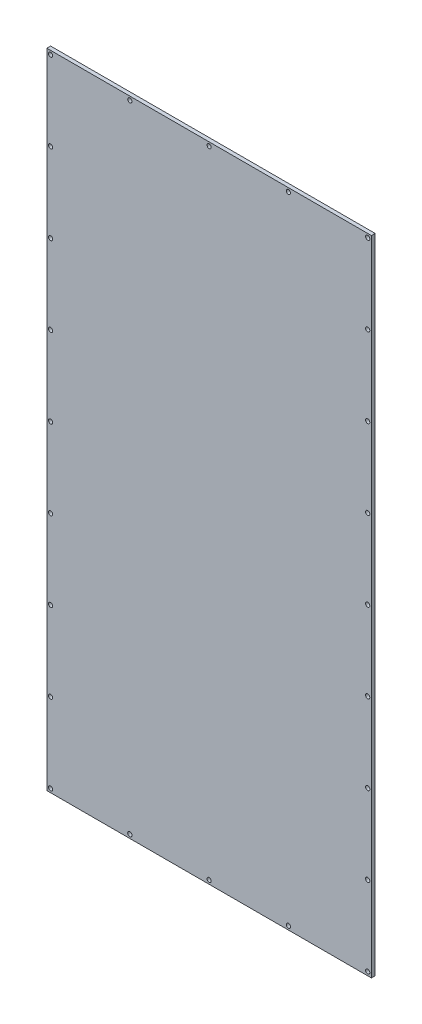
ISO-10303-21;
HEADER;
FILE_DESCRIPTION(('STEP AP214'),'2;1');
FILE_NAME('part.step','',(''),(''),'','','');
FILE_SCHEMA(('AUTOMOTIVE_DESIGN { 1 0 10303 214 1 1 1 1 }'));
ENDSEC;
DATA;
#1=APPLICATION_CONTEXT('core data for automotive mechanical design processes');
#2=APPLICATION_PROTOCOL_DEFINITION('international standard','automotive_design',2000,#1);
#3=PRODUCT_CONTEXT('',#1,'mechanical');
#4=PRODUCT('Part','Part','',(#3));
#5=PRODUCT_RELATED_PRODUCT_CATEGORY('part','',(#4));
#6=PRODUCT_DEFINITION_FORMATION('','',#4);
#7=PRODUCT_DEFINITION_CONTEXT('part definition',#1,'design');
#8=PRODUCT_DEFINITION('design','',#6,#7);
#9=PRODUCT_DEFINITION_SHAPE('','',#8);
#10=(LENGTH_UNIT() NAMED_UNIT(*) SI_UNIT(.MILLI.,.METRE.));
#11=(NAMED_UNIT(*) PLANE_ANGLE_UNIT() SI_UNIT($,.RADIAN.));
#12=(NAMED_UNIT(*) SI_UNIT($,.STERADIAN.) SOLID_ANGLE_UNIT());
#13=UNCERTAINTY_MEASURE_WITH_UNIT(LENGTH_MEASURE(1.E-05),#10,'distance_accuracy_value','');
#14=(GEOMETRIC_REPRESENTATION_CONTEXT(3) GLOBAL_UNCERTAINTY_ASSIGNED_CONTEXT((#13)) GLOBAL_UNIT_ASSIGNED_CONTEXT((#10,
#11,#12)) REPRESENTATION_CONTEXT('',''));
#15=CARTESIAN_POINT('',(0.,0.,0.));
#16=DIRECTION('',(0.,0.,1.));
#17=DIRECTION('',(1.,0.,0.));
#18=AXIS2_PLACEMENT_3D('',#15,#16,#17);
#19=CARTESIAN_POINT('',(0.,0.,0.));
#20=DIRECTION('',(0.,0.,-1.));
#21=DIRECTION('',(-1.,0.,0.));
#22=AXIS2_PLACEMENT_3D('',#19,#20,#21);
#23=PLANE('',#22);
#24=CARTESIAN_POINT('',(3.,3.,0.));
#25=DIRECTION('',(0.,0.,1.));
#26=DIRECTION('',(1.,0.,0.));
#27=AXIS2_PLACEMENT_3D('',#24,#25,#26);
#28=CIRCLE('',#27,1.7);
#29=CARTESIAN_POINT('',(4.7,3.,0.));
#30=VERTEX_POINT('',#29);
#31=EDGE_CURVE('E236',#30,#30,#28,.T.);
#32=ORIENTED_EDGE('',*,*,#31,.T.);
#33=EDGE_LOOP('',(#32));
#34=FACE_BOUND('',#33,.T.);
#35=CARTESIAN_POINT('',(66.5,3.,0.));
#36=DIRECTION('',(0.,0.,1.));
#37=DIRECTION('',(1.,0.,0.));
#38=AXIS2_PLACEMENT_3D('',#35,#36,#37);
#39=CIRCLE('',#38,1.69999999999999);
#40=CARTESIAN_POINT('',(68.2,3.,0.));
#41=VERTEX_POINT('',#40);
#42=EDGE_CURVE('E230',#41,#41,#39,.T.);
#43=ORIENTED_EDGE('',*,*,#42,.T.);
#44=EDGE_LOOP('',(#43));
#45=FACE_BOUND('',#44,.T.);
#46=CARTESIAN_POINT('',(3.,130.25,0.));
#47=DIRECTION('',(0.,0.,1.));
#48=DIRECTION('',(1.,0.,0.));
#49=AXIS2_PLACEMENT_3D('',#46,#47,#48);
#50=CIRCLE('',#49,1.7);
#51=CARTESIAN_POINT('',(4.7,130.25,0.));
#52=VERTEX_POINT('',#51);
#53=EDGE_CURVE('E212',#52,#52,#50,.T.);
#54=ORIENTED_EDGE('',*,*,#53,.T.);
#55=EDGE_LOOP('',(#54));
#56=FACE_BOUND('',#55,.T.);
#57=CARTESIAN_POINT('',(3.,193.875,0.));
#58=DIRECTION('',(0.,0.,1.));
#59=DIRECTION('',(1.,0.,0.));
#60=AXIS2_PLACEMENT_3D('',#57,#58,#59);
#61=CIRCLE('',#60,1.7);
#62=CARTESIAN_POINT('',(4.7,193.875,0.));
#63=VERTEX_POINT('',#62);
#64=EDGE_CURVE('E206',#63,#63,#61,.T.);
#65=ORIENTED_EDGE('',*,*,#64,.T.);
#66=EDGE_LOOP('',(#65));
#67=FACE_BOUND('',#66,.T.);
#68=CARTESIAN_POINT('',(3.,321.125,0.));
#69=DIRECTION('',(0.,0.,1.));
#70=DIRECTION('',(1.,0.,0.));
#71=AXIS2_PLACEMENT_3D('',#68,#69,#70);
#72=CIRCLE('',#71,1.7);
#73=CARTESIAN_POINT('',(4.7,321.125,0.));
#74=VERTEX_POINT('',#73);
#75=EDGE_CURVE('E188',#74,#74,#72,.T.);
#76=ORIENTED_EDGE('',*,*,#75,.T.);
#77=EDGE_LOOP('',(#76));
#78=FACE_BOUND('',#77,.T.);
#79=CARTESIAN_POINT('',(3.,257.5,0.));
#80=DIRECTION('',(0.,0.,1.));
#81=DIRECTION('',(1.,0.,0.));
#82=AXIS2_PLACEMENT_3D('',#79,#80,#81);
#83=CIRCLE('',#82,1.7);
#84=CARTESIAN_POINT('',(4.7,257.5,0.));
#85=VERTEX_POINT('',#84);
#86=EDGE_CURVE('E182',#85,#85,#83,.T.);
#87=ORIENTED_EDGE('',*,*,#86,.T.);
#88=EDGE_LOOP('',(#87));
#89=FACE_BOUND('',#88,.T.);
#90=CARTESIAN_POINT('',(257.,130.25,0.));
#91=DIRECTION('',(0.,0.,1.));
#92=DIRECTION('',(1.,0.,0.));
#93=AXIS2_PLACEMENT_3D('',#90,#91,#92);
#94=CIRCLE('',#93,1.69999999999998);
#95=CARTESIAN_POINT('',(258.7,130.25,0.));
#96=VERTEX_POINT('',#95);
#97=EDGE_CURVE('E146',#96,#96,#94,.T.);
#98=ORIENTED_EDGE('',*,*,#97,.T.);
#99=EDGE_LOOP('',(#98));
#100=FACE_BOUND('',#99,.T.);
#101=CARTESIAN_POINT('',(257.,193.875,0.));
#102=DIRECTION('',(0.,0.,1.));
#103=DIRECTION('',(1.,0.,0.));
#104=AXIS2_PLACEMENT_3D('',#101,#102,#103);
#105=CIRCLE('',#104,1.69999999999998);
#106=CARTESIAN_POINT('',(258.7,193.875,0.));
#107=VERTEX_POINT('',#106);
#108=EDGE_CURVE('E140',#107,#107,#105,.T.);
#109=ORIENTED_EDGE('',*,*,#108,.T.);
#110=EDGE_LOOP('',(#109));
#111=FACE_BOUND('',#110,.T.);
#112=CARTESIAN_POINT('',(257.,448.375,0.));
#113=DIRECTION('',(0.,0.,1.));
#114=DIRECTION('',(1.,0.,0.));
#115=AXIS2_PLACEMENT_3D('',#112,#113,#114);
#116=CIRCLE('',#115,1.69999999999998);
#117=CARTESIAN_POINT('',(258.7,448.375,0.));
#118=VERTEX_POINT('',#117);
#119=EDGE_CURVE('E134',#118,#118,#116,.T.);
#120=ORIENTED_EDGE('',*,*,#119,.T.);
#121=EDGE_LOOP('',(#120));
#122=FACE_BOUND('',#121,.T.);
#123=CARTESIAN_POINT('',(257.,384.75,0.));
#124=DIRECTION('',(0.,0.,1.));
#125=DIRECTION('',(1.,0.,0.));
#126=AXIS2_PLACEMENT_3D('',#123,#124,#125);
#127=CIRCLE('',#126,1.69999999999998);
#128=CARTESIAN_POINT('',(258.7,384.75,0.));
#129=VERTEX_POINT('',#128);
#130=EDGE_CURVE('E128',#129,#129,#127,.T.);
#131=ORIENTED_EDGE('',*,*,#130,.T.);
#132=EDGE_LOOP('',(#131));
#133=FACE_BOUND('',#132,.T.);
#134=CARTESIAN_POINT('',(257.,321.125,0.));
#135=DIRECTION('',(0.,0.,1.));
#136=DIRECTION('',(1.,0.,0.));
#137=AXIS2_PLACEMENT_3D('',#134,#135,#136);
#138=CIRCLE('',#137,1.69999999999998);
#139=CARTESIAN_POINT('',(258.7,321.125,0.));
#140=VERTEX_POINT('',#139);
#141=EDGE_CURVE('E122',#140,#140,#138,.T.);
#142=ORIENTED_EDGE('',*,*,#141,.T.);
#143=EDGE_LOOP('',(#142));
#144=FACE_BOUND('',#143,.T.);
#145=CARTESIAN_POINT('',(130.,512.,0.));
#146=DIRECTION('',(0.,0.,1.));
#147=DIRECTION('',(1.,0.,0.));
#148=AXIS2_PLACEMENT_3D('',#145,#146,#147);
#149=CIRCLE('',#148,1.70000000000001);
#150=CARTESIAN_POINT('',(131.7,512.,0.));
#151=VERTEX_POINT('',#150);
#152=EDGE_CURVE('E116',#151,#151,#149,.T.);
#153=ORIENTED_EDGE('',*,*,#152,.T.);
#154=EDGE_LOOP('',(#153));
#155=FACE_BOUND('',#154,.T.);
#156=CARTESIAN_POINT('',(257.,257.5,0.));
#157=DIRECTION('',(0.,0.,1.));
#158=DIRECTION('',(1.,0.,0.));
#159=AXIS2_PLACEMENT_3D('',#156,#157,#158);
#160=CIRCLE('',#159,1.69999999999998);
#161=CARTESIAN_POINT('',(258.7,257.5,0.));
#162=VERTEX_POINT('',#161);
#163=EDGE_CURVE('E100',#162,#162,#160,.T.);
#164=ORIENTED_EDGE('',*,*,#163,.T.);
#165=EDGE_LOOP('',(#164));
#166=FACE_BOUND('',#165,.T.);
#167=DIRECTION('',(0.,-1.,0.));
#168=VECTOR('',#167,1.);
#169=CARTESIAN_POINT('',(0.,0.,0.));
#170=LINE('',#169,#168);
#171=CARTESIAN_POINT('',(0.,515.,0.));
#172=VERTEX_POINT('',#171);
#173=CARTESIAN_POINT('',(0.,0.,0.));
#174=VERTEX_POINT('',#173);
#175=EDGE_CURVE('E97',#172,#174,#170,.T.);
#176=ORIENTED_EDGE('',*,*,#175,.F.);
#177=DIRECTION('',(-1.,0.,0.));
#178=VECTOR('',#177,1.);
#179=CARTESIAN_POINT('',(0.,515.,0.));
#180=LINE('',#179,#178);
#181=CARTESIAN_POINT('',(260.,515.,0.));
#182=VERTEX_POINT('',#181);
#183=EDGE_CURVE('E72',#182,#172,#180,.T.);
#184=ORIENTED_EDGE('',*,*,#183,.F.);
#185=DIRECTION('',(0.,1.,0.));
#186=VECTOR('',#185,1.);
#187=CARTESIAN_POINT('',(260.,0.,0.));
#188=LINE('',#187,#186);
#189=CARTESIAN_POINT('',(260.,0.,0.));
#190=VERTEX_POINT('',#189);
#191=EDGE_CURVE('E66',#190,#182,#188,.T.);
#192=ORIENTED_EDGE('',*,*,#191,.F.);
#193=DIRECTION('',(1.,0.,0.));
#194=VECTOR('',#193,1.);
#195=CARTESIAN_POINT('',(0.,0.,0.));
#196=LINE('',#195,#194);
#197=EDGE_CURVE('E89',#174,#190,#196,.T.);
#198=ORIENTED_EDGE('',*,*,#197,.F.);
#199=EDGE_LOOP('',(#176,#184,#192,#198));
#200=FACE_BOUND('',#199,.T.);
#201=CARTESIAN_POINT('',(257.,66.625,0.));
#202=DIRECTION('',(0.,0.,1.));
#203=DIRECTION('',(1.,0.,0.));
#204=AXIS2_PLACEMENT_3D('',#201,#202,#203);
#205=CIRCLE('',#204,1.69999999999998);
#206=CARTESIAN_POINT('',(258.7,66.625,0.));
#207=VERTEX_POINT('',#206);
#208=EDGE_CURVE('E152',#207,#207,#205,.T.);
#209=ORIENTED_EDGE('',*,*,#208,.T.);
#210=EDGE_LOOP('',(#209));
#211=FACE_BOUND('',#210,.T.);
#212=CARTESIAN_POINT('',(66.5,512.,0.));
#213=DIRECTION('',(0.,0.,1.));
#214=DIRECTION('',(1.,0.,0.));
#215=AXIS2_PLACEMENT_3D('',#212,#213,#214);
#216=CIRCLE('',#215,1.69999999999999);
#217=CARTESIAN_POINT('',(68.2,512.,0.));
#218=VERTEX_POINT('',#217);
#219=EDGE_CURVE('E158',#218,#218,#216,.T.);
#220=ORIENTED_EDGE('',*,*,#219,.T.);
#221=EDGE_LOOP('',(#220));
#222=FACE_BOUND('',#221,.T.);
#223=CARTESIAN_POINT('',(3.,512.,0.));
#224=DIRECTION('',(0.,0.,1.));
#225=DIRECTION('',(1.,0.,0.));
#226=AXIS2_PLACEMENT_3D('',#223,#224,#225);
#227=CIRCLE('',#226,1.7);
#228=CARTESIAN_POINT('',(4.7,512.,0.));
#229=VERTEX_POINT('',#228);
#230=EDGE_CURVE('E164',#229,#229,#227,.T.);
#231=ORIENTED_EDGE('',*,*,#230,.T.);
#232=EDGE_LOOP('',(#231));
#233=FACE_BOUND('',#232,.T.);
#234=CARTESIAN_POINT('',(193.5,512.,0.));
#235=DIRECTION('',(0.,0.,1.));
#236=DIRECTION('',(1.,0.,0.));
#237=AXIS2_PLACEMENT_3D('',#234,#235,#236);
#238=CIRCLE('',#237,1.70000000000001);
#239=CARTESIAN_POINT('',(195.2,512.,0.));
#240=VERTEX_POINT('',#239);
#241=EDGE_CURVE('E170',#240,#240,#238,.T.);
#242=ORIENTED_EDGE('',*,*,#241,.T.);
#243=EDGE_LOOP('',(#242));
#244=FACE_BOUND('',#243,.T.);
#245=CARTESIAN_POINT('',(257.,512.,0.));
#246=DIRECTION('',(0.,0.,1.));
#247=DIRECTION('',(1.,0.,0.));
#248=AXIS2_PLACEMENT_3D('',#245,#246,#247);
#249=CIRCLE('',#248,1.69999999999998);
#250=CARTESIAN_POINT('',(258.7,512.,0.));
#251=VERTEX_POINT('',#250);
#252=EDGE_CURVE('E176',#251,#251,#249,.T.);
#253=ORIENTED_EDGE('',*,*,#252,.T.);
#254=EDGE_LOOP('',(#253));
#255=FACE_BOUND('',#254,.T.);
#256=CARTESIAN_POINT('',(3.,384.75,0.));
#257=DIRECTION('',(0.,0.,1.));
#258=DIRECTION('',(1.,0.,0.));
#259=AXIS2_PLACEMENT_3D('',#256,#257,#258);
#260=CIRCLE('',#259,1.7);
#261=CARTESIAN_POINT('',(4.7,384.75,0.));
#262=VERTEX_POINT('',#261);
#263=EDGE_CURVE('E194',#262,#262,#260,.T.);
#264=ORIENTED_EDGE('',*,*,#263,.T.);
#265=EDGE_LOOP('',(#264));
#266=FACE_BOUND('',#265,.T.);
#267=CARTESIAN_POINT('',(3.,448.375,0.));
#268=DIRECTION('',(0.,0.,1.));
#269=DIRECTION('',(1.,0.,0.));
#270=AXIS2_PLACEMENT_3D('',#267,#268,#269);
#271=CIRCLE('',#270,1.7);
#272=CARTESIAN_POINT('',(4.7,448.375,0.));
#273=VERTEX_POINT('',#272);
#274=EDGE_CURVE('E200',#273,#273,#271,.T.);
#275=ORIENTED_EDGE('',*,*,#274,.T.);
#276=EDGE_LOOP('',(#275));
#277=FACE_BOUND('',#276,.T.);
#278=CARTESIAN_POINT('',(3.,66.625,0.));
#279=DIRECTION('',(0.,0.,1.));
#280=DIRECTION('',(1.,0.,0.));
#281=AXIS2_PLACEMENT_3D('',#278,#279,#280);
#282=CIRCLE('',#281,1.7);
#283=CARTESIAN_POINT('',(4.7,66.625,0.));
#284=VERTEX_POINT('',#283);
#285=EDGE_CURVE('E218',#284,#284,#282,.T.);
#286=ORIENTED_EDGE('',*,*,#285,.T.);
#287=EDGE_LOOP('',(#286));
#288=FACE_BOUND('',#287,.T.);
#289=CARTESIAN_POINT('',(130.,3.,0.));
#290=DIRECTION('',(0.,0.,1.));
#291=DIRECTION('',(1.,0.,0.));
#292=AXIS2_PLACEMENT_3D('',#289,#290,#291);
#293=CIRCLE('',#292,1.70000000000001);
#294=CARTESIAN_POINT('',(131.7,3.,0.));
#295=VERTEX_POINT('',#294);
#296=EDGE_CURVE('E224',#295,#295,#293,.T.);
#297=ORIENTED_EDGE('',*,*,#296,.T.);
#298=EDGE_LOOP('',(#297));
#299=FACE_BOUND('',#298,.T.);
#300=CARTESIAN_POINT('',(193.5,3.,0.));
#301=DIRECTION('',(0.,0.,1.));
#302=DIRECTION('',(1.,0.,0.));
#303=AXIS2_PLACEMENT_3D('',#300,#301,#302);
#304=CIRCLE('',#303,1.70000000000001);
#305=CARTESIAN_POINT('',(195.2,3.,0.));
#306=VERTEX_POINT('',#305);
#307=EDGE_CURVE('E242',#306,#306,#304,.T.);
#308=ORIENTED_EDGE('',*,*,#307,.T.);
#309=EDGE_LOOP('',(#308));
#310=FACE_BOUND('',#309,.T.);
#311=CARTESIAN_POINT('',(257.,3.,0.));
#312=DIRECTION('',(0.,0.,1.));
#313=DIRECTION('',(1.,0.,0.));
#314=AXIS2_PLACEMENT_3D('',#311,#312,#313);
#315=CIRCLE('',#314,1.69999999999998);
#316=CARTESIAN_POINT('',(258.7,3.,0.));
#317=VERTEX_POINT('',#316);
#318=EDGE_CURVE('E248',#317,#317,#315,.T.);
#319=ORIENTED_EDGE('',*,*,#318,.T.);
#320=EDGE_LOOP('',(#319));
#321=FACE_BOUND('',#320,.T.);
#322=ADVANCED_FACE('F32',(#34,#45,#56,#67,#78,#89,#100,#111,#122,#133,#144,#155,#166,#200,#211,
#222,#233,#244,#255,#266,#277,#288,#299,#310,#321),#23,.T.);
#323=CARTESIAN_POINT('',(0.,0.,2.9972));
#324=DIRECTION('',(0.,0.,-1.));
#325=DIRECTION('',(-1.,0.,0.));
#326=AXIS2_PLACEMENT_3D('',#323,#324,#325);
#327=PLANE('',#326);
#328=CARTESIAN_POINT('',(257.,3.,2.9972));
#329=DIRECTION('',(0.,0.,1.));
#330=DIRECTION('',(1.,0.,0.));
#331=AXIS2_PLACEMENT_3D('',#328,#329,#330);
#332=CIRCLE('',#331,1.69999999999998);
#333=CARTESIAN_POINT('',(258.7,3.,2.9972));
#334=VERTEX_POINT('',#333);
#335=EDGE_CURVE('E251',#334,#334,#332,.T.);
#336=ORIENTED_EDGE('',*,*,#335,.F.);
#337=EDGE_LOOP('',(#336));
#338=FACE_BOUND('',#337,.T.);
#339=CARTESIAN_POINT('',(3.,3.,2.9972));
#340=DIRECTION('',(0.,0.,1.));
#341=DIRECTION('',(1.,0.,0.));
#342=AXIS2_PLACEMENT_3D('',#339,#340,#341);
#343=CIRCLE('',#342,1.69999999999999);
#344=CARTESIAN_POINT('',(4.69999999999999,3.,2.9972));
#345=VERTEX_POINT('',#344);
#346=EDGE_CURVE('E239',#345,#345,#343,.T.);
#347=ORIENTED_EDGE('',*,*,#346,.F.);
#348=EDGE_LOOP('',(#347));
#349=FACE_BOUND('',#348,.T.);
#350=CARTESIAN_POINT('',(130.,3.,2.9972));
#351=DIRECTION('',(0.,0.,1.));
#352=DIRECTION('',(1.,0.,0.));
#353=AXIS2_PLACEMENT_3D('',#350,#351,#352);
#354=CIRCLE('',#353,1.69999999999998);
#355=CARTESIAN_POINT('',(131.7,3.,2.9972));
#356=VERTEX_POINT('',#355);
#357=EDGE_CURVE('E227',#356,#356,#354,.T.);
#358=ORIENTED_EDGE('',*,*,#357,.F.);
#359=EDGE_LOOP('',(#358));
#360=FACE_BOUND('',#359,.T.);
#361=CARTESIAN_POINT('',(3.,130.25,2.9972));
#362=DIRECTION('',(0.,0.,1.));
#363=DIRECTION('',(1.,0.,0.));
#364=AXIS2_PLACEMENT_3D('',#361,#362,#363);
#365=CIRCLE('',#364,1.69999999999999);
#366=CARTESIAN_POINT('',(4.69999999999999,130.25,2.9972));
#367=VERTEX_POINT('',#366);
#368=EDGE_CURVE('E215',#367,#367,#365,.T.);
#369=ORIENTED_EDGE('',*,*,#368,.F.);
#370=EDGE_LOOP('',(#369));
#371=FACE_BOUND('',#370,.T.);
#372=CARTESIAN_POINT('',(3.,448.375,2.9972));
#373=DIRECTION('',(0.,0.,1.));
#374=DIRECTION('',(1.,0.,0.));
#375=AXIS2_PLACEMENT_3D('',#372,#373,#374);
#376=CIRCLE('',#375,1.69999999999999);
#377=CARTESIAN_POINT('',(4.69999999999999,448.375,2.9972));
#378=VERTEX_POINT('',#377);
#379=EDGE_CURVE('E203',#378,#378,#376,.T.);
#380=ORIENTED_EDGE('',*,*,#379,.F.);
#381=EDGE_LOOP('',(#380));
#382=FACE_BOUND('',#381,.T.);
#383=CARTESIAN_POINT('',(3.,321.125,2.9972));
#384=DIRECTION('',(0.,0.,1.));
#385=DIRECTION('',(1.,0.,0.));
#386=AXIS2_PLACEMENT_3D('',#383,#384,#385);
#387=CIRCLE('',#386,1.69999999999999);
#388=CARTESIAN_POINT('',(4.69999999999999,321.125,2.9972));
#389=VERTEX_POINT('',#388);
#390=EDGE_CURVE('E191',#389,#389,#387,.T.);
#391=ORIENTED_EDGE('',*,*,#390,.F.);
#392=EDGE_LOOP('',(#391));
#393=FACE_BOUND('',#392,.T.);
#394=CARTESIAN_POINT('',(257.,512.,2.9972));
#395=DIRECTION('',(0.,0.,1.));
#396=DIRECTION('',(1.,0.,0.));
#397=AXIS2_PLACEMENT_3D('',#394,#395,#396);
#398=CIRCLE('',#397,1.69999999999998);
#399=CARTESIAN_POINT('',(258.7,512.,2.9972));
#400=VERTEX_POINT('',#399);
#401=EDGE_CURVE('E179',#400,#400,#398,.T.);
#402=ORIENTED_EDGE('',*,*,#401,.F.);
#403=EDGE_LOOP('',(#402));
#404=FACE_BOUND('',#403,.T.);
#405=CARTESIAN_POINT('',(3.,512.,2.9972));
#406=DIRECTION('',(0.,0.,1.));
#407=DIRECTION('',(1.,0.,0.));
#408=AXIS2_PLACEMENT_3D('',#405,#406,#407);
#409=CIRCLE('',#408,1.69999999999999);
#410=CARTESIAN_POINT('',(4.69999999999999,512.,2.9972));
#411=VERTEX_POINT('',#410);
#412=EDGE_CURVE('E167',#411,#411,#409,.T.);
#413=ORIENTED_EDGE('',*,*,#412,.F.);
#414=EDGE_LOOP('',(#413));
#415=FACE_BOUND('',#414,.T.);
#416=CARTESIAN_POINT('',(66.5,512.,2.9972));
#417=DIRECTION('',(0.,0.,1.));
#418=DIRECTION('',(1.,0.,0.));
#419=AXIS2_PLACEMENT_3D('',#416,#417,#418);
#420=CIRCLE('',#419,1.69999999999999);
#421=CARTESIAN_POINT('',(68.2,512.,2.9972));
#422=VERTEX_POINT('',#421);
#423=EDGE_CURVE('E161',#422,#422,#420,.T.);
#424=ORIENTED_EDGE('',*,*,#423,.F.);
#425=EDGE_LOOP('',(#424));
#426=FACE_BOUND('',#425,.T.);
#427=CARTESIAN_POINT('',(257.,66.625,2.9972));
#428=DIRECTION('',(0.,0.,1.));
#429=DIRECTION('',(1.,0.,0.));
#430=AXIS2_PLACEMENT_3D('',#427,#428,#429);
#431=CIRCLE('',#430,1.69999999999998);
#432=CARTESIAN_POINT('',(258.7,66.625,2.9972));
#433=VERTEX_POINT('',#432);
#434=EDGE_CURVE('E155',#433,#433,#431,.T.);
#435=ORIENTED_EDGE('',*,*,#434,.F.);
#436=EDGE_LOOP('',(#435));
#437=FACE_BOUND('',#436,.T.);
#438=CARTESIAN_POINT('',(257.,130.25,2.9972));
#439=DIRECTION('',(0.,0.,1.));
#440=DIRECTION('',(1.,0.,0.));
#441=AXIS2_PLACEMENT_3D('',#438,#439,#440);
#442=CIRCLE('',#441,1.69999999999998);
#443=CARTESIAN_POINT('',(258.7,130.25,2.9972));
#444=VERTEX_POINT('',#443);
#445=EDGE_CURVE('E149',#444,#444,#442,.T.);
#446=ORIENTED_EDGE('',*,*,#445,.F.);
#447=EDGE_LOOP('',(#446));
#448=FACE_BOUND('',#447,.T.);
#449=CARTESIAN_POINT('',(257.,193.875,2.9972));
#450=DIRECTION('',(0.,0.,1.));
#451=DIRECTION('',(1.,0.,0.));
#452=AXIS2_PLACEMENT_3D('',#449,#450,#451);
#453=CIRCLE('',#452,1.69999999999998);
#454=CARTESIAN_POINT('',(258.7,193.875,2.9972));
#455=VERTEX_POINT('',#454);
#456=EDGE_CURVE('E143',#455,#455,#453,.T.);
#457=ORIENTED_EDGE('',*,*,#456,.F.);
#458=EDGE_LOOP('',(#457));
#459=FACE_BOUND('',#458,.T.);
#460=CARTESIAN_POINT('',(257.,448.375,2.9972));
#461=DIRECTION('',(0.,0.,1.));
#462=DIRECTION('',(1.,0.,0.));
#463=AXIS2_PLACEMENT_3D('',#460,#461,#462);
#464=CIRCLE('',#463,1.69999999999998);
#465=CARTESIAN_POINT('',(258.7,448.375,2.9972));
#466=VERTEX_POINT('',#465);
#467=EDGE_CURVE('E137',#466,#466,#464,.T.);
#468=ORIENTED_EDGE('',*,*,#467,.F.);
#469=EDGE_LOOP('',(#468));
#470=FACE_BOUND('',#469,.T.);
#471=CARTESIAN_POINT('',(257.,384.75,2.9972));
#472=DIRECTION('',(0.,0.,1.));
#473=DIRECTION('',(1.,0.,0.));
#474=AXIS2_PLACEMENT_3D('',#471,#472,#473);
#475=CIRCLE('',#474,1.69999999999998);
#476=CARTESIAN_POINT('',(258.7,384.75,2.9972));
#477=VERTEX_POINT('',#476);
#478=EDGE_CURVE('E131',#477,#477,#475,.T.);
#479=ORIENTED_EDGE('',*,*,#478,.F.);
#480=EDGE_LOOP('',(#479));
#481=FACE_BOUND('',#480,.T.);
#482=CARTESIAN_POINT('',(257.,321.125,2.9972));
#483=DIRECTION('',(0.,0.,1.));
#484=DIRECTION('',(1.,0.,0.));
#485=AXIS2_PLACEMENT_3D('',#482,#483,#484);
#486=CIRCLE('',#485,1.69999999999998);
#487=CARTESIAN_POINT('',(258.7,321.125,2.9972));
#488=VERTEX_POINT('',#487);
#489=EDGE_CURVE('E125',#488,#488,#486,.T.);
#490=ORIENTED_EDGE('',*,*,#489,.F.);
#491=EDGE_LOOP('',(#490));
#492=FACE_BOUND('',#491,.T.);
#493=CARTESIAN_POINT('',(130.,512.,2.9972));
#494=DIRECTION('',(0.,0.,1.));
#495=DIRECTION('',(1.,0.,0.));
#496=AXIS2_PLACEMENT_3D('',#493,#494,#495);
#497=CIRCLE('',#496,1.69999999999998);
#498=CARTESIAN_POINT('',(131.7,512.,2.9972));
#499=VERTEX_POINT('',#498);
#500=EDGE_CURVE('E119',#499,#499,#497,.T.);
#501=ORIENTED_EDGE('',*,*,#500,.F.);
#502=EDGE_LOOP('',(#501));
#503=FACE_BOUND('',#502,.T.);
#504=CARTESIAN_POINT('',(257.,257.5,2.9972));
#505=DIRECTION('',(0.,0.,1.));
#506=DIRECTION('',(1.,0.,0.));
#507=AXIS2_PLACEMENT_3D('',#504,#505,#506);
#508=CIRCLE('',#507,1.69999999999998);
#509=CARTESIAN_POINT('',(258.7,257.5,2.9972));
#510=VERTEX_POINT('',#509);
#511=EDGE_CURVE('E113',#510,#510,#508,.T.);
#512=ORIENTED_EDGE('',*,*,#511,.F.);
#513=EDGE_LOOP('',(#512));
#514=FACE_BOUND('',#513,.T.);
#515=DIRECTION('',(0.,-1.,0.));
#516=VECTOR('',#515,1.);
#517=CARTESIAN_POINT('',(0.,0.,2.9972));
#518=LINE('',#517,#516);
#519=CARTESIAN_POINT('',(0.,515.,2.9972));
#520=VERTEX_POINT('',#519);
#521=CARTESIAN_POINT('',(0.,0.,2.9972));
#522=VERTEX_POINT('',#521);
#523=EDGE_CURVE('E85',#520,#522,#518,.T.);
#524=ORIENTED_EDGE('',*,*,#523,.T.);
#525=DIRECTION('',(1.,0.,0.));
#526=VECTOR('',#525,1.);
#527=CARTESIAN_POINT('',(0.,0.,2.9972));
#528=LINE('',#527,#526);
#529=CARTESIAN_POINT('',(260.,0.,2.9972));
#530=VERTEX_POINT('',#529);
#531=EDGE_CURVE('E79',#522,#530,#528,.T.);
#532=ORIENTED_EDGE('',*,*,#531,.T.);
#533=DIRECTION('',(0.,1.,0.));
#534=VECTOR('',#533,1.);
#535=CARTESIAN_POINT('',(260.,0.,2.9972));
#536=LINE('',#535,#534);
#537=CARTESIAN_POINT('',(260.,515.,2.9972));
#538=VERTEX_POINT('',#537);
#539=EDGE_CURVE('E83',#530,#538,#536,.T.);
#540=ORIENTED_EDGE('',*,*,#539,.T.);
#541=DIRECTION('',(-1.,0.,0.));
#542=VECTOR('',#541,1.);
#543=CARTESIAN_POINT('',(0.,515.,2.9972));
#544=LINE('',#543,#542);
#545=EDGE_CURVE('E49',#538,#520,#544,.T.);
#546=ORIENTED_EDGE('',*,*,#545,.T.);
#547=EDGE_LOOP('',(#524,#532,#540,#546));
#548=FACE_BOUND('',#547,.T.);
#549=CARTESIAN_POINT('',(193.5,512.,2.9972));
#550=DIRECTION('',(0.,0.,1.));
#551=DIRECTION('',(1.,0.,0.));
#552=AXIS2_PLACEMENT_3D('',#549,#550,#551);
#553=CIRCLE('',#552,1.69999999999998);
#554=CARTESIAN_POINT('',(195.2,512.,2.9972));
#555=VERTEX_POINT('',#554);
#556=EDGE_CURVE('E173',#555,#555,#553,.T.);
#557=ORIENTED_EDGE('',*,*,#556,.F.);
#558=EDGE_LOOP('',(#557));
#559=FACE_BOUND('',#558,.T.);
#560=CARTESIAN_POINT('',(3.,257.5,2.9972));
#561=DIRECTION('',(0.,0.,1.));
#562=DIRECTION('',(1.,0.,0.));
#563=AXIS2_PLACEMENT_3D('',#560,#561,#562);
#564=CIRCLE('',#563,1.69999999999999);
#565=CARTESIAN_POINT('',(4.69999999999999,257.5,2.9972));
#566=VERTEX_POINT('',#565);
#567=EDGE_CURVE('E185',#566,#566,#564,.T.);
#568=ORIENTED_EDGE('',*,*,#567,.F.);
#569=EDGE_LOOP('',(#568));
#570=FACE_BOUND('',#569,.T.);
#571=CARTESIAN_POINT('',(3.,384.75,2.9972));
#572=DIRECTION('',(0.,0.,1.));
#573=DIRECTION('',(1.,0.,0.));
#574=AXIS2_PLACEMENT_3D('',#571,#572,#573);
#575=CIRCLE('',#574,1.69999999999999);
#576=CARTESIAN_POINT('',(4.69999999999999,384.75,2.9972));
#577=VERTEX_POINT('',#576);
#578=EDGE_CURVE('E197',#577,#577,#575,.T.);
#579=ORIENTED_EDGE('',*,*,#578,.F.);
#580=EDGE_LOOP('',(#579));
#581=FACE_BOUND('',#580,.T.);
#582=CARTESIAN_POINT('',(3.,193.875,2.9972));
#583=DIRECTION('',(0.,0.,1.));
#584=DIRECTION('',(1.,0.,0.));
#585=AXIS2_PLACEMENT_3D('',#582,#583,#584);
#586=CIRCLE('',#585,1.69999999999999);
#587=CARTESIAN_POINT('',(4.69999999999999,193.875,2.9972));
#588=VERTEX_POINT('',#587);
#589=EDGE_CURVE('E209',#588,#588,#586,.T.);
#590=ORIENTED_EDGE('',*,*,#589,.F.);
#591=EDGE_LOOP('',(#590));
#592=FACE_BOUND('',#591,.T.);
#593=CARTESIAN_POINT('',(3.,66.625,2.9972));
#594=DIRECTION('',(0.,0.,1.));
#595=DIRECTION('',(1.,0.,0.));
#596=AXIS2_PLACEMENT_3D('',#593,#594,#595);
#597=CIRCLE('',#596,1.69999999999999);
#598=CARTESIAN_POINT('',(4.69999999999999,66.625,2.9972));
#599=VERTEX_POINT('',#598);
#600=EDGE_CURVE('E221',#599,#599,#597,.T.);
#601=ORIENTED_EDGE('',*,*,#600,.F.);
#602=EDGE_LOOP('',(#601));
#603=FACE_BOUND('',#602,.T.);
#604=CARTESIAN_POINT('',(66.5,3.,2.9972));
#605=DIRECTION('',(0.,0.,1.));
#606=DIRECTION('',(1.,0.,0.));
#607=AXIS2_PLACEMENT_3D('',#604,#605,#606);
#608=CIRCLE('',#607,1.69999999999999);
#609=CARTESIAN_POINT('',(68.2,3.,2.9972));
#610=VERTEX_POINT('',#609);
#611=EDGE_CURVE('E233',#610,#610,#608,.T.);
#612=ORIENTED_EDGE('',*,*,#611,.F.);
#613=EDGE_LOOP('',(#612));
#614=FACE_BOUND('',#613,.T.);
#615=CARTESIAN_POINT('',(193.5,3.,2.9972));
#616=DIRECTION('',(0.,0.,1.));
#617=DIRECTION('',(1.,0.,0.));
#618=AXIS2_PLACEMENT_3D('',#615,#616,#617);
#619=CIRCLE('',#618,1.69999999999998);
#620=CARTESIAN_POINT('',(195.2,3.,2.9972));
#621=VERTEX_POINT('',#620);
#622=EDGE_CURVE('E245',#621,#621,#619,.T.);
#623=ORIENTED_EDGE('',*,*,#622,.F.);
#624=EDGE_LOOP('',(#623));
#625=FACE_BOUND('',#624,.T.);
#626=ADVANCED_FACE('F80',(#338,#349,#360,#371,#382,#393,#404,#415,#426,#437,#448,#459,#470,#481,
#492,#503,#514,#548,#559,#570,#581,#592,#603,#614,#625),#327,.F.);
#627=CARTESIAN_POINT('',(0.,0.,2.9972));
#628=DIRECTION('',(1.,0.,0.));
#629=DIRECTION('',(0.,0.,-1.));
#630=AXIS2_PLACEMENT_3D('',#627,#628,#629);
#631=PLANE('',#630);
#632=ORIENTED_EDGE('',*,*,#175,.T.);
#633=DIRECTION('',(0.,0.,-1.));
#634=VECTOR('',#633,1.);
#635=CARTESIAN_POINT('',(0.,0.,2.9972));
#636=LINE('',#635,#634);
#637=EDGE_CURVE('E11',#522,#174,#636,.T.);
#638=ORIENTED_EDGE('',*,*,#637,.F.);
#639=ORIENTED_EDGE('',*,*,#523,.F.);
#640=DIRECTION('',(0.,0.,-1.));
#641=VECTOR('',#640,1.);
#642=CARTESIAN_POINT('',(0.,515.,2.9972));
#643=LINE('',#642,#641);
#644=EDGE_CURVE('E93',#520,#172,#643,.T.);
#645=ORIENTED_EDGE('',*,*,#644,.T.);
#646=EDGE_LOOP('',(#632,#638,#639,#645));
#647=FACE_BOUND('',#646,.T.);
#648=ADVANCED_FACE('F34',(#647),#631,.F.);
#649=CARTESIAN_POINT('',(0.,0.,2.9972));
#650=DIRECTION('',(0.,1.,0.));
#651=DIRECTION('',(0.,0.,1.));
#652=AXIS2_PLACEMENT_3D('',#649,#650,#651);
#653=PLANE('',#652);
#654=ORIENTED_EDGE('',*,*,#197,.T.);
#655=DIRECTION('',(0.,0.,-1.));
#656=VECTOR('',#655,1.);
#657=CARTESIAN_POINT('',(260.,0.,2.9972));
#658=LINE('',#657,#656);
#659=EDGE_CURVE('E41',#530,#190,#658,.T.);
#660=ORIENTED_EDGE('',*,*,#659,.F.);
#661=ORIENTED_EDGE('',*,*,#531,.F.);
#662=ORIENTED_EDGE('',*,*,#637,.T.);
#663=EDGE_LOOP('',(#654,#660,#661,#662));
#664=FACE_BOUND('',#663,.T.);
#665=ADVANCED_FACE('F88',(#664),#653,.F.);
#666=CARTESIAN_POINT('',(260.,0.,2.9972));
#667=DIRECTION('',(-1.,0.,0.));
#668=DIRECTION('',(0.,0.,1.));
#669=AXIS2_PLACEMENT_3D('',#666,#667,#668);
#670=PLANE('',#669);
#671=ORIENTED_EDGE('',*,*,#191,.T.);
#672=DIRECTION('',(0.,0.,-1.));
#673=VECTOR('',#672,1.);
#674=CARTESIAN_POINT('',(260.,515.,2.9972));
#675=LINE('',#674,#673);
#676=EDGE_CURVE('E90',#538,#182,#675,.T.);
#677=ORIENTED_EDGE('',*,*,#676,.F.);
#678=ORIENTED_EDGE('',*,*,#539,.F.);
#679=ORIENTED_EDGE('',*,*,#659,.T.);
#680=EDGE_LOOP('',(#671,#677,#678,#679));
#681=FACE_BOUND('',#680,.T.);
#682=ADVANCED_FACE('F91',(#681),#670,.F.);
#683=CARTESIAN_POINT('',(0.,515.,2.9972));
#684=DIRECTION('',(0.,-1.,0.));
#685=DIRECTION('',(0.,0.,-1.));
#686=AXIS2_PLACEMENT_3D('',#683,#684,#685);
#687=PLANE('',#686);
#688=ORIENTED_EDGE('',*,*,#183,.T.);
#689=ORIENTED_EDGE('',*,*,#644,.F.);
#690=ORIENTED_EDGE('',*,*,#545,.F.);
#691=ORIENTED_EDGE('',*,*,#676,.T.);
#692=EDGE_LOOP('',(#688,#689,#690,#691));
#693=FACE_BOUND('',#692,.T.);
#694=ADVANCED_FACE('F105',(#693),#687,.F.);
#695=CARTESIAN_POINT('',(257.,257.5,2.9972));
#696=DIRECTION('',(0.,0.,1.));
#697=DIRECTION('',(1.,0.,0.));
#698=AXIS2_PLACEMENT_3D('',#695,#696,#697);
#699=CYLINDRICAL_SURFACE('',#698,1.69999999999998);
#700=ORIENTED_EDGE('',*,*,#163,.F.);
#701=EDGE_LOOP('',(#700));
#702=FACE_BOUND('',#701,.T.);
#703=ORIENTED_EDGE('',*,*,#511,.T.);
#704=EDGE_LOOP('',(#703));
#705=FACE_BOUND('',#704,.T.);
#706=ADVANCED_FACE('F292',(#702,#705),#699,.F.);
#707=CARTESIAN_POINT('',(130.,512.,2.9972));
#708=DIRECTION('',(0.,0.,1.));
#709=DIRECTION('',(1.,0.,0.));
#710=AXIS2_PLACEMENT_3D('',#707,#708,#709);
#711=CYLINDRICAL_SURFACE('',#710,1.69999999999999);
#712=ORIENTED_EDGE('',*,*,#152,.F.);
#713=EDGE_LOOP('',(#712));
#714=FACE_BOUND('',#713,.T.);
#715=ORIENTED_EDGE('',*,*,#500,.T.);
#716=EDGE_LOOP('',(#715));
#717=FACE_BOUND('',#716,.T.);
#718=ADVANCED_FACE('F294',(#714,#717),#711,.F.);
#719=CARTESIAN_POINT('',(257.,321.125,2.9972));
#720=DIRECTION('',(0.,0.,1.));
#721=DIRECTION('',(1.,0.,0.));
#722=AXIS2_PLACEMENT_3D('',#719,#720,#721);
#723=CYLINDRICAL_SURFACE('',#722,1.69999999999998);
#724=ORIENTED_EDGE('',*,*,#141,.F.);
#725=EDGE_LOOP('',(#724));
#726=FACE_BOUND('',#725,.T.);
#727=ORIENTED_EDGE('',*,*,#489,.T.);
#728=EDGE_LOOP('',(#727));
#729=FACE_BOUND('',#728,.T.);
#730=ADVANCED_FACE('F301',(#726,#729),#723,.F.);
#731=CARTESIAN_POINT('',(257.,384.75,2.9972));
#732=DIRECTION('',(0.,0.,1.));
#733=DIRECTION('',(1.,0.,0.));
#734=AXIS2_PLACEMENT_3D('',#731,#732,#733);
#735=CYLINDRICAL_SURFACE('',#734,1.69999999999998);
#736=ORIENTED_EDGE('',*,*,#130,.F.);
#737=EDGE_LOOP('',(#736));
#738=FACE_BOUND('',#737,.T.);
#739=ORIENTED_EDGE('',*,*,#478,.T.);
#740=EDGE_LOOP('',(#739));
#741=FACE_BOUND('',#740,.T.);
#742=ADVANCED_FACE('F442',(#738,#741),#735,.F.);
#743=CARTESIAN_POINT('',(257.,448.375,2.9972));
#744=DIRECTION('',(0.,0.,1.));
#745=DIRECTION('',(1.,0.,0.));
#746=AXIS2_PLACEMENT_3D('',#743,#744,#745);
#747=CYLINDRICAL_SURFACE('',#746,1.69999999999998);
#748=ORIENTED_EDGE('',*,*,#119,.F.);
#749=EDGE_LOOP('',(#748));
#750=FACE_BOUND('',#749,.T.);
#751=ORIENTED_EDGE('',*,*,#467,.T.);
#752=EDGE_LOOP('',(#751));
#753=FACE_BOUND('',#752,.T.);
#754=ADVANCED_FACE('F438',(#750,#753),#747,.F.);
#755=CARTESIAN_POINT('',(257.,193.875,2.9972));
#756=DIRECTION('',(0.,0.,1.));
#757=DIRECTION('',(1.,0.,0.));
#758=AXIS2_PLACEMENT_3D('',#755,#756,#757);
#759=CYLINDRICAL_SURFACE('',#758,1.69999999999998);
#760=ORIENTED_EDGE('',*,*,#108,.F.);
#761=EDGE_LOOP('',(#760));
#762=FACE_BOUND('',#761,.T.);
#763=ORIENTED_EDGE('',*,*,#456,.T.);
#764=EDGE_LOOP('',(#763));
#765=FACE_BOUND('',#764,.T.);
#766=ADVANCED_FACE('F434',(#762,#765),#759,.F.);
#767=CARTESIAN_POINT('',(257.,130.25,2.9972));
#768=DIRECTION('',(0.,0.,1.));
#769=DIRECTION('',(1.,0.,0.));
#770=AXIS2_PLACEMENT_3D('',#767,#768,#769);
#771=CYLINDRICAL_SURFACE('',#770,1.69999999999998);
#772=ORIENTED_EDGE('',*,*,#97,.F.);
#773=EDGE_LOOP('',(#772));
#774=FACE_BOUND('',#773,.T.);
#775=ORIENTED_EDGE('',*,*,#445,.T.);
#776=EDGE_LOOP('',(#775));
#777=FACE_BOUND('',#776,.T.);
#778=ADVANCED_FACE('F430',(#774,#777),#771,.F.);
#779=CARTESIAN_POINT('',(257.,66.625,2.9972));
#780=DIRECTION('',(0.,0.,1.));
#781=DIRECTION('',(1.,0.,0.));
#782=AXIS2_PLACEMENT_3D('',#779,#780,#781);
#783=CYLINDRICAL_SURFACE('',#782,1.69999999999998);
#784=ORIENTED_EDGE('',*,*,#208,.F.);
#785=EDGE_LOOP('',(#784));
#786=FACE_BOUND('',#785,.T.);
#787=ORIENTED_EDGE('',*,*,#434,.T.);
#788=EDGE_LOOP('',(#787));
#789=FACE_BOUND('',#788,.T.);
#790=ADVANCED_FACE('F426',(#786,#789),#783,.F.);
#791=CARTESIAN_POINT('',(66.5,512.,2.9972));
#792=DIRECTION('',(0.,0.,1.));
#793=DIRECTION('',(1.,0.,0.));
#794=AXIS2_PLACEMENT_3D('',#791,#792,#793);
#795=CYLINDRICAL_SURFACE('',#794,1.69999999999999);
#796=ORIENTED_EDGE('',*,*,#219,.F.);
#797=EDGE_LOOP('',(#796));
#798=FACE_BOUND('',#797,.T.);
#799=ORIENTED_EDGE('',*,*,#423,.T.);
#800=EDGE_LOOP('',(#799));
#801=FACE_BOUND('',#800,.T.);
#802=ADVANCED_FACE('F422',(#798,#801),#795,.F.);
#803=CARTESIAN_POINT('',(3.,512.,2.9972));
#804=DIRECTION('',(0.,0.,1.));
#805=DIRECTION('',(1.,0.,0.));
#806=AXIS2_PLACEMENT_3D('',#803,#804,#805);
#807=CYLINDRICAL_SURFACE('',#806,1.69999999999999);
#808=ORIENTED_EDGE('',*,*,#230,.F.);
#809=EDGE_LOOP('',(#808));
#810=FACE_BOUND('',#809,.T.);
#811=ORIENTED_EDGE('',*,*,#412,.T.);
#812=EDGE_LOOP('',(#811));
#813=FACE_BOUND('',#812,.T.);
#814=ADVANCED_FACE('F418',(#810,#813),#807,.F.);
#815=CARTESIAN_POINT('',(193.5,512.,2.9972));
#816=DIRECTION('',(0.,0.,1.));
#817=DIRECTION('',(1.,0.,0.));
#818=AXIS2_PLACEMENT_3D('',#815,#816,#817);
#819=CYLINDRICAL_SURFACE('',#818,1.69999999999999);
#820=ORIENTED_EDGE('',*,*,#241,.F.);
#821=EDGE_LOOP('',(#820));
#822=FACE_BOUND('',#821,.T.);
#823=ORIENTED_EDGE('',*,*,#556,.T.);
#824=EDGE_LOOP('',(#823));
#825=FACE_BOUND('',#824,.T.);
#826=ADVANCED_FACE('F414',(#822,#825),#819,.F.);
#827=CARTESIAN_POINT('',(257.,512.,2.9972));
#828=DIRECTION('',(0.,0.,1.));
#829=DIRECTION('',(1.,0.,0.));
#830=AXIS2_PLACEMENT_3D('',#827,#828,#829);
#831=CYLINDRICAL_SURFACE('',#830,1.69999999999998);
#832=ORIENTED_EDGE('',*,*,#252,.F.);
#833=EDGE_LOOP('',(#832));
#834=FACE_BOUND('',#833,.T.);
#835=ORIENTED_EDGE('',*,*,#401,.T.);
#836=EDGE_LOOP('',(#835));
#837=FACE_BOUND('',#836,.T.);
#838=ADVANCED_FACE('F410',(#834,#837),#831,.F.);
#839=CARTESIAN_POINT('',(3.,257.5,2.9972));
#840=DIRECTION('',(0.,0.,1.));
#841=DIRECTION('',(1.,0.,0.));
#842=AXIS2_PLACEMENT_3D('',#839,#840,#841);
#843=CYLINDRICAL_SURFACE('',#842,1.69999999999999);
#844=ORIENTED_EDGE('',*,*,#86,.F.);
#845=EDGE_LOOP('',(#844));
#846=FACE_BOUND('',#845,.T.);
#847=ORIENTED_EDGE('',*,*,#567,.T.);
#848=EDGE_LOOP('',(#847));
#849=FACE_BOUND('',#848,.T.);
#850=ADVANCED_FACE('F406',(#846,#849),#843,.F.);
#851=CARTESIAN_POINT('',(3.,321.125,2.9972));
#852=DIRECTION('',(0.,0.,1.));
#853=DIRECTION('',(1.,0.,0.));
#854=AXIS2_PLACEMENT_3D('',#851,#852,#853);
#855=CYLINDRICAL_SURFACE('',#854,1.69999999999999);
#856=ORIENTED_EDGE('',*,*,#75,.F.);
#857=EDGE_LOOP('',(#856));
#858=FACE_BOUND('',#857,.T.);
#859=ORIENTED_EDGE('',*,*,#390,.T.);
#860=EDGE_LOOP('',(#859));
#861=FACE_BOUND('',#860,.T.);
#862=ADVANCED_FACE('F402',(#858,#861),#855,.F.);
#863=CARTESIAN_POINT('',(3.,384.75,2.9972));
#864=DIRECTION('',(0.,0.,1.));
#865=DIRECTION('',(1.,0.,0.));
#866=AXIS2_PLACEMENT_3D('',#863,#864,#865);
#867=CYLINDRICAL_SURFACE('',#866,1.69999999999999);
#868=ORIENTED_EDGE('',*,*,#263,.F.);
#869=EDGE_LOOP('',(#868));
#870=FACE_BOUND('',#869,.T.);
#871=ORIENTED_EDGE('',*,*,#578,.T.);
#872=EDGE_LOOP('',(#871));
#873=FACE_BOUND('',#872,.T.);
#874=ADVANCED_FACE('F398',(#870,#873),#867,.F.);
#875=CARTESIAN_POINT('',(3.,448.375,2.9972));
#876=DIRECTION('',(0.,0.,1.));
#877=DIRECTION('',(1.,0.,0.));
#878=AXIS2_PLACEMENT_3D('',#875,#876,#877);
#879=CYLINDRICAL_SURFACE('',#878,1.69999999999999);
#880=ORIENTED_EDGE('',*,*,#274,.F.);
#881=EDGE_LOOP('',(#880));
#882=FACE_BOUND('',#881,.T.);
#883=ORIENTED_EDGE('',*,*,#379,.T.);
#884=EDGE_LOOP('',(#883));
#885=FACE_BOUND('',#884,.T.);
#886=ADVANCED_FACE('F394',(#882,#885),#879,.F.);
#887=CARTESIAN_POINT('',(3.,193.875,2.9972));
#888=DIRECTION('',(0.,0.,1.));
#889=DIRECTION('',(1.,0.,0.));
#890=AXIS2_PLACEMENT_3D('',#887,#888,#889);
#891=CYLINDRICAL_SURFACE('',#890,1.69999999999999);
#892=ORIENTED_EDGE('',*,*,#64,.F.);
#893=EDGE_LOOP('',(#892));
#894=FACE_BOUND('',#893,.T.);
#895=ORIENTED_EDGE('',*,*,#589,.T.);
#896=EDGE_LOOP('',(#895));
#897=FACE_BOUND('',#896,.T.);
#898=ADVANCED_FACE('F390',(#894,#897),#891,.F.);
#899=CARTESIAN_POINT('',(3.,130.25,2.9972));
#900=DIRECTION('',(0.,0.,1.));
#901=DIRECTION('',(1.,0.,0.));
#902=AXIS2_PLACEMENT_3D('',#899,#900,#901);
#903=CYLINDRICAL_SURFACE('',#902,1.69999999999999);
#904=ORIENTED_EDGE('',*,*,#53,.F.);
#905=EDGE_LOOP('',(#904));
#906=FACE_BOUND('',#905,.T.);
#907=ORIENTED_EDGE('',*,*,#368,.T.);
#908=EDGE_LOOP('',(#907));
#909=FACE_BOUND('',#908,.T.);
#910=ADVANCED_FACE('F386',(#906,#909),#903,.F.);
#911=CARTESIAN_POINT('',(3.,66.625,2.9972));
#912=DIRECTION('',(0.,0.,1.));
#913=DIRECTION('',(1.,0.,0.));
#914=AXIS2_PLACEMENT_3D('',#911,#912,#913);
#915=CYLINDRICAL_SURFACE('',#914,1.69999999999999);
#916=ORIENTED_EDGE('',*,*,#285,.F.);
#917=EDGE_LOOP('',(#916));
#918=FACE_BOUND('',#917,.T.);
#919=ORIENTED_EDGE('',*,*,#600,.T.);
#920=EDGE_LOOP('',(#919));
#921=FACE_BOUND('',#920,.T.);
#922=ADVANCED_FACE('F338',(#918,#921),#915,.F.);
#923=CARTESIAN_POINT('',(130.,3.,2.9972));
#924=DIRECTION('',(0.,0.,1.));
#925=DIRECTION('',(1.,0.,0.));
#926=AXIS2_PLACEMENT_3D('',#923,#924,#925);
#927=CYLINDRICAL_SURFACE('',#926,1.69999999999999);
#928=ORIENTED_EDGE('',*,*,#296,.F.);
#929=EDGE_LOOP('',(#928));
#930=FACE_BOUND('',#929,.T.);
#931=ORIENTED_EDGE('',*,*,#357,.T.);
#932=EDGE_LOOP('',(#931));
#933=FACE_BOUND('',#932,.T.);
#934=ADVANCED_FACE('F333',(#930,#933),#927,.F.);
#935=CARTESIAN_POINT('',(66.5,3.,2.9972));
#936=DIRECTION('',(0.,0.,1.));
#937=DIRECTION('',(1.,0.,0.));
#938=AXIS2_PLACEMENT_3D('',#935,#936,#937);
#939=CYLINDRICAL_SURFACE('',#938,1.69999999999999);
#940=ORIENTED_EDGE('',*,*,#42,.F.);
#941=EDGE_LOOP('',(#940));
#942=FACE_BOUND('',#941,.T.);
#943=ORIENTED_EDGE('',*,*,#611,.T.);
#944=EDGE_LOOP('',(#943));
#945=FACE_BOUND('',#944,.T.);
#946=ADVANCED_FACE('F337',(#942,#945),#939,.F.);
#947=CARTESIAN_POINT('',(3.,3.,2.9972));
#948=DIRECTION('',(0.,0.,1.));
#949=DIRECTION('',(1.,0.,0.));
#950=AXIS2_PLACEMENT_3D('',#947,#948,#949);
#951=CYLINDRICAL_SURFACE('',#950,1.69999999999999);
#952=ORIENTED_EDGE('',*,*,#31,.F.);
#953=EDGE_LOOP('',(#952));
#954=FACE_BOUND('',#953,.T.);
#955=ORIENTED_EDGE('',*,*,#346,.T.);
#956=EDGE_LOOP('',(#955));
#957=FACE_BOUND('',#956,.T.);
#958=ADVANCED_FACE('F350',(#954,#957),#951,.F.);
#959=CARTESIAN_POINT('',(193.5,3.,2.9972));
#960=DIRECTION('',(0.,0.,1.));
#961=DIRECTION('',(1.,0.,0.));
#962=AXIS2_PLACEMENT_3D('',#959,#960,#961);
#963=CYLINDRICAL_SURFACE('',#962,1.69999999999999);
#964=ORIENTED_EDGE('',*,*,#307,.F.);
#965=EDGE_LOOP('',(#964));
#966=FACE_BOUND('',#965,.T.);
#967=ORIENTED_EDGE('',*,*,#622,.T.);
#968=EDGE_LOOP('',(#967));
#969=FACE_BOUND('',#968,.T.);
#970=ADVANCED_FACE('F360',(#966,#969),#963,.F.);
#971=CARTESIAN_POINT('',(257.,3.,2.9972));
#972=DIRECTION('',(0.,0.,1.));
#973=DIRECTION('',(1.,0.,0.));
#974=AXIS2_PLACEMENT_3D('',#971,#972,#973);
#975=CYLINDRICAL_SURFACE('',#974,1.69999999999998);
#976=ORIENTED_EDGE('',*,*,#318,.F.);
#977=EDGE_LOOP('',(#976));
#978=FACE_BOUND('',#977,.T.);
#979=ORIENTED_EDGE('',*,*,#335,.T.);
#980=EDGE_LOOP('',(#979));
#981=FACE_BOUND('',#980,.T.);
#982=ADVANCED_FACE('F255',(#978,#981),#975,.F.);
#983=CLOSED_SHELL('',(#322,#626,#648,#665,#682,#694,#706,#718,#730,#742,#754,#766,#778,#790,
#802,#814,#826,#838,#850,#862,#874,#886,#898,#910,#922,#934,#946,#958,#970,#982));
#984=MANIFOLD_SOLID_BREP('B2',#983);
#985=ADVANCED_BREP_SHAPE_REPRESENTATION('',(#18,#984),#14);
#986=SHAPE_DEFINITION_REPRESENTATION(#9,#985);
ENDSEC;
END-ISO-10303-21;
